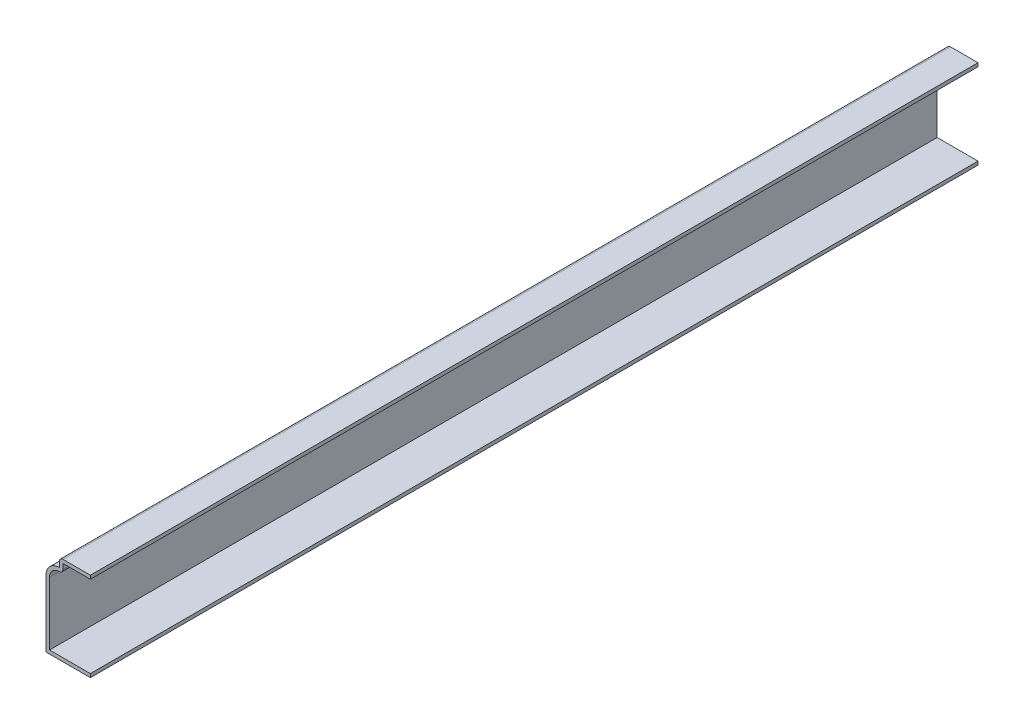
ISO-10303-21;
HEADER;
FILE_DESCRIPTION(('STEP AP214'),'2;1');
FILE_NAME('part.step','',(''),(''),'','','');
FILE_SCHEMA(('AUTOMOTIVE_DESIGN { 1 0 10303 214 1 1 1 1 }'));
ENDSEC;
DATA;
#1=APPLICATION_CONTEXT('core data for automotive mechanical design processes');
#2=APPLICATION_PROTOCOL_DEFINITION('international standard','automotive_design',2000,#1);
#3=PRODUCT_CONTEXT('',#1,'mechanical');
#4=PRODUCT('Part','Part','',(#3));
#5=PRODUCT_RELATED_PRODUCT_CATEGORY('part','',(#4));
#6=PRODUCT_DEFINITION_FORMATION('','',#4);
#7=PRODUCT_DEFINITION_CONTEXT('part definition',#1,'design');
#8=PRODUCT_DEFINITION('design','',#6,#7);
#9=PRODUCT_DEFINITION_SHAPE('','',#8);
#10=(LENGTH_UNIT() NAMED_UNIT(*) SI_UNIT(.MILLI.,.METRE.));
#11=(NAMED_UNIT(*) PLANE_ANGLE_UNIT() SI_UNIT($,.RADIAN.));
#12=(NAMED_UNIT(*) SI_UNIT($,.STERADIAN.) SOLID_ANGLE_UNIT());
#13=UNCERTAINTY_MEASURE_WITH_UNIT(LENGTH_MEASURE(1.E-05),#10,'distance_accuracy_value','');
#14=(GEOMETRIC_REPRESENTATION_CONTEXT(3) GLOBAL_UNCERTAINTY_ASSIGNED_CONTEXT((#13)) GLOBAL_UNIT_ASSIGNED_CONTEXT((#10,
#11,#12)) REPRESENTATION_CONTEXT('',''));
#15=CARTESIAN_POINT('',(0.,0.,0.));
#16=DIRECTION('',(0.,0.,1.));
#17=DIRECTION('',(1.,0.,0.));
#18=AXIS2_PLACEMENT_3D('',#15,#16,#17);
#19=CARTESIAN_POINT('',(-11.1125,30.48,-317.5));
#20=DIRECTION('',(0.,-1.,0.));
#21=DIRECTION('',(0.,0.,-1.));
#22=AXIS2_PLACEMENT_3D('',#19,#20,#21);
#23=PLANE('',#22);
#24=DIRECTION('',(1.,0.,0.));
#25=VECTOR('',#24,1.);
#26=CARTESIAN_POINT('',(-11.1125,30.48,0.));
#27=LINE('',#26,#25);
#28=CARTESIAN_POINT('',(-9.8425,30.48,0.));
#29=VERTEX_POINT('',#28);
#30=CARTESIAN_POINT('',(0.,30.48,0.));
#31=VERTEX_POINT('',#30);
#32=EDGE_CURVE('E186',#29,#31,#27,.T.);
#33=ORIENTED_EDGE('',*,*,#32,.F.);
#34=DIRECTION('',(0.,0.,1.));
#35=VECTOR('',#34,1.);
#36=CARTESIAN_POINT('',(-9.8425,30.48,-317.5));
#37=LINE('',#36,#35);
#38=CARTESIAN_POINT('',(-9.8425,30.48,-317.5));
#39=VERTEX_POINT('',#38);
#40=EDGE_CURVE('E159',#39,#29,#37,.T.);
#41=ORIENTED_EDGE('',*,*,#40,.F.);
#42=DIRECTION('',(1.,0.,0.));
#43=VECTOR('',#42,1.);
#44=CARTESIAN_POINT('',(-11.1125,30.48,-317.5));
#45=LINE('',#44,#43);
#46=CARTESIAN_POINT('',(0.,30.48,-317.5));
#47=VERTEX_POINT('',#46);
#48=EDGE_CURVE('E140',#39,#47,#45,.T.);
#49=ORIENTED_EDGE('',*,*,#48,.T.);
#50=DIRECTION('',(0.,0.,1.));
#51=VECTOR('',#50,1.);
#52=CARTESIAN_POINT('',(0.,30.48,-317.5));
#53=LINE('',#52,#51);
#54=EDGE_CURVE('E147',#47,#31,#53,.T.);
#55=ORIENTED_EDGE('',*,*,#54,.T.);
#56=EDGE_LOOP('',(#33,#41,#49,#55));
#57=FACE_BOUND('',#56,.T.);
#58=ADVANCED_FACE('F35',(#57),#23,.T.);
#59=CARTESIAN_POINT('',(-9.8425,28.575,-317.5));
#60=DIRECTION('',(1.,0.,0.));
#61=DIRECTION('',(0.,0.,-1.));
#62=AXIS2_PLACEMENT_3D('',#59,#60,#61);
#63=PLANE('',#62);
#64=DIRECTION('',(0.,1.,0.));
#65=VECTOR('',#64,1.);
#66=CARTESIAN_POINT('',(-9.8425,28.575,0.));
#67=LINE('',#66,#65);
#68=CARTESIAN_POINT('',(-9.8425,28.575,0.));
#69=VERTEX_POINT('',#68);
#70=EDGE_CURVE('E160',#69,#29,#67,.T.);
#71=ORIENTED_EDGE('',*,*,#70,.F.);
#72=DIRECTION('',(0.,0.,1.));
#73=VECTOR('',#72,1.);
#74=CARTESIAN_POINT('',(-9.8425,28.575,-317.5));
#75=LINE('',#74,#73);
#76=CARTESIAN_POINT('',(-9.8425,28.575,-317.5));
#77=VERTEX_POINT('',#76);
#78=EDGE_CURVE('E236',#69,#77,#75,.F.);
#79=ORIENTED_EDGE('',*,*,#78,.T.);
#80=DIRECTION('',(0.,1.,0.));
#81=VECTOR('',#80,1.);
#82=CARTESIAN_POINT('',(-9.8425,28.575,-317.5));
#83=LINE('',#82,#81);
#84=EDGE_CURVE('E155',#77,#39,#83,.T.);
#85=ORIENTED_EDGE('',*,*,#84,.T.);
#86=ORIENTED_EDGE('',*,*,#40,.T.);
#87=EDGE_LOOP('',(#71,#79,#85,#86));
#88=FACE_BOUND('',#87,.T.);
#89=ADVANCED_FACE('F252',(#88),#63,.T.);
#90=CARTESIAN_POINT('',(-11.1125,23.8125,-317.5));
#91=DIRECTION('',(0.,0.,1.));
#92=DIRECTION('',(1.,0.,0.));
#93=AXIS2_PLACEMENT_3D('',#90,#91,#92);
#94=CYLINDRICAL_SURFACE('',#93,3.4925);
#95=CARTESIAN_POINT('',(-11.1125,23.8125,-317.5));
#96=DIRECTION('',(0.,0.,1.));
#97=DIRECTION('',(1.,0.,0.));
#98=AXIS2_PLACEMENT_3D('',#95,#96,#97);
#99=CIRCLE('',#98,3.4925);
#100=CARTESIAN_POINT('',(-14.605,23.8125,-317.5));
#101=VERTEX_POINT('',#100);
#102=CARTESIAN_POINT('',(-11.1125,27.305,-317.5));
#103=VERTEX_POINT('',#102);
#104=EDGE_CURVE('E182',#101,#103,#99,.F.);
#105=ORIENTED_EDGE('',*,*,#104,.T.);
#106=DIRECTION('',(0.,0.,1.));
#107=VECTOR('',#106,1.);
#108=CARTESIAN_POINT('',(-11.1125,27.305,-317.5));
#109=LINE('',#108,#107);
#110=CARTESIAN_POINT('',(-11.1125,27.305,0.));
#111=VERTEX_POINT('',#110);
#112=EDGE_CURVE('E210',#103,#111,#109,.T.);
#113=ORIENTED_EDGE('',*,*,#112,.T.);
#114=CARTESIAN_POINT('',(-11.1125,23.8125,0.));
#115=DIRECTION('',(0.,0.,1.));
#116=DIRECTION('',(1.,0.,0.));
#117=AXIS2_PLACEMENT_3D('',#114,#115,#116);
#118=CIRCLE('',#117,3.4925);
#119=CARTESIAN_POINT('',(-14.605,23.8125,0.));
#120=VERTEX_POINT('',#119);
#121=EDGE_CURVE('E162',#120,#111,#118,.F.);
#122=ORIENTED_EDGE('',*,*,#121,.F.);
#123=DIRECTION('',(0.,0.,1.));
#124=VECTOR('',#123,1.);
#125=CARTESIAN_POINT('',(-14.605,23.8125,-317.5));
#126=LINE('',#125,#124);
#127=EDGE_CURVE('E211',#101,#120,#126,.T.);
#128=ORIENTED_EDGE('',*,*,#127,.F.);
#129=EDGE_LOOP('',(#105,#113,#122,#128));
#130=FACE_BOUND('',#129,.T.);
#131=ADVANCED_FACE('F260',(#130),#94,.F.);
#132=CARTESIAN_POINT('',(-14.605,0.,-317.5));
#133=DIRECTION('',(1.,0.,0.));
#134=DIRECTION('',(0.,0.,-1.));
#135=AXIS2_PLACEMENT_3D('',#132,#133,#134);
#136=PLANE('',#135);
#137=DIRECTION('',(0.,1.,0.));
#138=VECTOR('',#137,1.);
#139=CARTESIAN_POINT('',(-14.605,0.,0.));
#140=LINE('',#139,#138);
#141=CARTESIAN_POINT('',(-14.605,1.27,0.));
#142=VERTEX_POINT('',#141);
#143=EDGE_CURVE('E204',#142,#120,#140,.T.);
#144=ORIENTED_EDGE('',*,*,#143,.F.);
#145=DIRECTION('',(0.,0.,1.));
#146=VECTOR('',#145,1.);
#147=CARTESIAN_POINT('',(-14.605,1.27,-317.5));
#148=LINE('',#147,#146);
#149=CARTESIAN_POINT('',(-14.605,1.27,-317.5));
#150=VERTEX_POINT('',#149);
#151=EDGE_CURVE('E213',#150,#142,#148,.T.);
#152=ORIENTED_EDGE('',*,*,#151,.F.);
#153=DIRECTION('',(0.,1.,0.));
#154=VECTOR('',#153,1.);
#155=CARTESIAN_POINT('',(-14.605,0.,-317.5));
#156=LINE('',#155,#154);
#157=EDGE_CURVE('E179',#150,#101,#156,.T.);
#158=ORIENTED_EDGE('',*,*,#157,.T.);
#159=ORIENTED_EDGE('',*,*,#127,.T.);
#160=EDGE_LOOP('',(#144,#152,#158,#159));
#161=FACE_BOUND('',#160,.T.);
#162=ADVANCED_FACE('F265',(#161),#136,.T.);
#163=CARTESIAN_POINT('',(0.,1.27,-317.5));
#164=DIRECTION('',(0.,1.,0.));
#165=DIRECTION('',(0.,0.,1.));
#166=AXIS2_PLACEMENT_3D('',#163,#164,#165);
#167=PLANE('',#166);
#168=DIRECTION('',(1.,0.,0.));
#169=VECTOR('',#168,1.);
#170=CARTESIAN_POINT('',(0.,1.27,0.));
#171=LINE('',#170,#169);
#172=CARTESIAN_POINT('',(0.,1.27,0.));
#173=VERTEX_POINT('',#172);
#174=EDGE_CURVE('E201',#173,#142,#171,.F.);
#175=ORIENTED_EDGE('',*,*,#174,.F.);
#176=DIRECTION('',(0.,0.,1.));
#177=VECTOR('',#176,1.);
#178=CARTESIAN_POINT('',(0.,1.27,-317.5));
#179=LINE('',#178,#177);
#180=CARTESIAN_POINT('',(0.,1.27,-317.5));
#181=VERTEX_POINT('',#180);
#182=EDGE_CURVE('E215',#181,#173,#179,.T.);
#183=ORIENTED_EDGE('',*,*,#182,.F.);
#184=DIRECTION('',(1.,0.,0.));
#185=VECTOR('',#184,1.);
#186=CARTESIAN_POINT('',(0.,1.27,-317.5));
#187=LINE('',#186,#185);
#188=EDGE_CURVE('E176',#181,#150,#187,.F.);
#189=ORIENTED_EDGE('',*,*,#188,.T.);
#190=ORIENTED_EDGE('',*,*,#151,.T.);
#191=EDGE_LOOP('',(#175,#183,#189,#190));
#192=FACE_BOUND('',#191,.T.);
#193=ADVANCED_FACE('F269',(#192),#167,.T.);
#194=CARTESIAN_POINT('',(0.,1.27,-317.5));
#195=DIRECTION('',(-1.,0.,0.));
#196=DIRECTION('',(0.,0.,1.));
#197=AXIS2_PLACEMENT_3D('',#194,#195,#196);
#198=PLANE('',#197);
#199=DIRECTION('',(0.,-1.,0.));
#200=VECTOR('',#199,1.);
#201=CARTESIAN_POINT('',(0.,1.27,0.));
#202=LINE('',#201,#200);
#203=CARTESIAN_POINT('',(0.,0.,0.));
#204=VERTEX_POINT('',#203);
#205=EDGE_CURVE('E199',#173,#204,#202,.T.);
#206=ORIENTED_EDGE('',*,*,#205,.T.);
#207=DIRECTION('',(0.,0.,1.));
#208=VECTOR('',#207,1.);
#209=CARTESIAN_POINT('',(0.,0.,-317.5));
#210=LINE('',#209,#208);
#211=CARTESIAN_POINT('',(0.,0.,-317.5));
#212=VERTEX_POINT('',#211);
#213=EDGE_CURVE('E217',#212,#204,#210,.T.);
#214=ORIENTED_EDGE('',*,*,#213,.F.);
#215=DIRECTION('',(0.,-1.,0.));
#216=VECTOR('',#215,1.);
#217=CARTESIAN_POINT('',(0.,1.27,-317.5));
#218=LINE('',#217,#216);
#219=EDGE_CURVE('E174',#181,#212,#218,.T.);
#220=ORIENTED_EDGE('',*,*,#219,.F.);
#221=ORIENTED_EDGE('',*,*,#182,.T.);
#222=EDGE_LOOP('',(#206,#214,#220,#221));
#223=FACE_BOUND('',#222,.T.);
#224=ADVANCED_FACE('F273',(#223),#198,.F.);
#225=CARTESIAN_POINT('',(0.,0.,-317.5));
#226=DIRECTION('',(0.,1.,0.));
#227=DIRECTION('',(0.,0.,1.));
#228=AXIS2_PLACEMENT_3D('',#225,#226,#227);
#229=PLANE('',#228);
#230=DIRECTION('',(-1.,0.,0.));
#231=VECTOR('',#230,1.);
#232=CARTESIAN_POINT('',(0.,0.,0.));
#233=LINE('',#232,#231);
#234=CARTESIAN_POINT('',(-15.875,0.,0.));
#235=VERTEX_POINT('',#234);
#236=EDGE_CURVE('E197',#204,#235,#233,.T.);
#237=ORIENTED_EDGE('',*,*,#236,.T.);
#238=DIRECTION('',(0.,0.,1.));
#239=VECTOR('',#238,1.);
#240=CARTESIAN_POINT('',(-15.875,0.,-317.5));
#241=LINE('',#240,#239);
#242=CARTESIAN_POINT('',(-15.875,0.,-317.5));
#243=VERTEX_POINT('',#242);
#244=EDGE_CURVE('E220',#243,#235,#241,.T.);
#245=ORIENTED_EDGE('',*,*,#244,.F.);
#246=DIRECTION('',(-1.,0.,0.));
#247=VECTOR('',#246,1.);
#248=CARTESIAN_POINT('',(0.,0.,-317.5));
#249=LINE('',#248,#247);
#250=EDGE_CURVE('E172',#212,#243,#249,.T.);
#251=ORIENTED_EDGE('',*,*,#250,.F.);
#252=ORIENTED_EDGE('',*,*,#213,.T.);
#253=EDGE_LOOP('',(#237,#245,#251,#252));
#254=FACE_BOUND('',#253,.T.);
#255=ADVANCED_FACE('F279',(#254),#229,.F.);
#256=CARTESIAN_POINT('',(-15.875,0.,-317.5));
#257=DIRECTION('',(1.,0.,0.));
#258=DIRECTION('',(0.,0.,-1.));
#259=AXIS2_PLACEMENT_3D('',#256,#257,#258);
#260=PLANE('',#259);
#261=DIRECTION('',(0.,1.,0.));
#262=VECTOR('',#261,1.);
#263=CARTESIAN_POINT('',(-15.875,0.,0.));
#264=LINE('',#263,#262);
#265=CARTESIAN_POINT('',(-15.875,23.8125,0.));
#266=VERTEX_POINT('',#265);
#267=EDGE_CURVE('E195',#235,#266,#264,.T.);
#268=ORIENTED_EDGE('',*,*,#267,.T.);
#269=DIRECTION('',(0.,0.,1.));
#270=VECTOR('',#269,1.);
#271=CARTESIAN_POINT('',(-15.875,23.8125,-317.5));
#272=LINE('',#271,#270);
#273=CARTESIAN_POINT('',(-15.875,23.8125,-317.5));
#274=VERTEX_POINT('',#273);
#275=EDGE_CURVE('E223',#274,#266,#272,.T.);
#276=ORIENTED_EDGE('',*,*,#275,.F.);
#277=DIRECTION('',(0.,1.,0.));
#278=VECTOR('',#277,1.);
#279=CARTESIAN_POINT('',(-15.875,0.,-317.5));
#280=LINE('',#279,#278);
#281=EDGE_CURVE('E170',#243,#274,#280,.T.);
#282=ORIENTED_EDGE('',*,*,#281,.F.);
#283=ORIENTED_EDGE('',*,*,#244,.T.);
#284=EDGE_LOOP('',(#268,#276,#282,#283));
#285=FACE_BOUND('',#284,.T.);
#286=ADVANCED_FACE('F283',(#285),#260,.F.);
#287=CARTESIAN_POINT('',(-11.1125,23.8125,-317.5));
#288=DIRECTION('',(0.,0.,1.));
#289=DIRECTION('',(1.,0.,0.));
#290=AXIS2_PLACEMENT_3D('',#287,#288,#289);
#291=CYLINDRICAL_SURFACE('',#290,4.7625);
#292=CARTESIAN_POINT('',(-11.1125,23.8125,0.));
#293=DIRECTION('',(0.,0.,-1.));
#294=DIRECTION('',(-1.,0.,0.));
#295=AXIS2_PLACEMENT_3D('',#292,#293,#294);
#296=CIRCLE('',#295,4.7625);
#297=CARTESIAN_POINT('',(-11.1125,28.575,0.));
#298=VERTEX_POINT('',#297);
#299=EDGE_CURVE('E193',#266,#298,#296,.T.);
#300=ORIENTED_EDGE('',*,*,#299,.T.);
#301=DIRECTION('',(0.,0.,1.));
#302=VECTOR('',#301,1.);
#303=CARTESIAN_POINT('',(-11.1125,28.575,-317.5));
#304=LINE('',#303,#302);
#305=CARTESIAN_POINT('',(-11.1125,28.575,-317.5));
#306=VERTEX_POINT('',#305);
#307=EDGE_CURVE('E226',#306,#298,#304,.T.);
#308=ORIENTED_EDGE('',*,*,#307,.F.);
#309=CARTESIAN_POINT('',(-11.1125,23.8125,-317.5));
#310=DIRECTION('',(0.,0.,-1.));
#311=DIRECTION('',(-1.,0.,0.));
#312=AXIS2_PLACEMENT_3D('',#309,#310,#311);
#313=CIRCLE('',#312,4.7625);
#314=EDGE_CURVE('E168',#274,#306,#313,.T.);
#315=ORIENTED_EDGE('',*,*,#314,.F.);
#316=ORIENTED_EDGE('',*,*,#275,.T.);
#317=EDGE_LOOP('',(#300,#308,#315,#316));
#318=FACE_BOUND('',#317,.T.);
#319=ADVANCED_FACE('F288',(#318),#291,.T.);
#320=CARTESIAN_POINT('',(-11.1125,28.575,-317.5));
#321=DIRECTION('',(1.,0.,0.));
#322=DIRECTION('',(0.,0.,-1.));
#323=AXIS2_PLACEMENT_3D('',#320,#321,#322);
#324=PLANE('',#323);
#325=DIRECTION('',(0.,1.,0.));
#326=VECTOR('',#325,1.);
#327=CARTESIAN_POINT('',(-11.1125,28.575,0.));
#328=LINE('',#327,#326);
#329=CARTESIAN_POINT('',(-11.1125,30.48,0.));
#330=VERTEX_POINT('',#329);
#331=EDGE_CURVE('E191',#298,#330,#328,.T.);
#332=ORIENTED_EDGE('',*,*,#331,.T.);
#333=DIRECTION('',(0.,0.,1.));
#334=VECTOR('',#333,1.);
#335=CARTESIAN_POINT('',(-11.1125,30.48,-317.5));
#336=LINE('',#335,#334);
#337=CARTESIAN_POINT('',(-11.1125,30.48,-317.5));
#338=VERTEX_POINT('',#337);
#339=EDGE_CURVE('E11',#330,#338,#336,.F.);
#340=ORIENTED_EDGE('',*,*,#339,.T.);
#341=DIRECTION('',(0.,1.,0.));
#342=VECTOR('',#341,1.);
#343=CARTESIAN_POINT('',(-11.1125,28.575,-317.5));
#344=LINE('',#343,#342);
#345=EDGE_CURVE('E166',#306,#338,#344,.T.);
#346=ORIENTED_EDGE('',*,*,#345,.F.);
#347=ORIENTED_EDGE('',*,*,#307,.T.);
#348=EDGE_LOOP('',(#332,#340,#346,#347));
#349=FACE_BOUND('',#348,.T.);
#350=ADVANCED_FACE('F304',(#349),#324,.F.);
#351=CARTESIAN_POINT('',(-11.1125,31.75,-317.5));
#352=DIRECTION('',(0.,-1.,0.));
#353=DIRECTION('',(0.,0.,-1.));
#354=AXIS2_PLACEMENT_3D('',#351,#352,#353);
#355=PLANE('',#354);
#356=DIRECTION('',(1.,0.,0.));
#357=VECTOR('',#356,1.);
#358=CARTESIAN_POINT('',(-11.1125,31.75,-317.5));
#359=LINE('',#358,#357);
#360=CARTESIAN_POINT('',(-9.8425,31.75,-317.5));
#361=VERTEX_POINT('',#360);
#362=CARTESIAN_POINT('',(0.,31.75,-317.5));
#363=VERTEX_POINT('',#362);
#364=EDGE_CURVE('E141',#361,#363,#359,.T.);
#365=ORIENTED_EDGE('',*,*,#364,.F.);
#366=DIRECTION('',(0.,0.,1.));
#367=VECTOR('',#366,1.);
#368=CARTESIAN_POINT('',(-9.8425,31.75,-317.5));
#369=LINE('',#368,#367);
#370=CARTESIAN_POINT('',(-9.8425,31.75,0.));
#371=VERTEX_POINT('',#370);
#372=EDGE_CURVE('E43',#361,#371,#369,.T.);
#373=ORIENTED_EDGE('',*,*,#372,.T.);
#374=DIRECTION('',(1.,0.,0.));
#375=VECTOR('',#374,1.);
#376=CARTESIAN_POINT('',(-11.1125,31.75,0.));
#377=LINE('',#376,#375);
#378=CARTESIAN_POINT('',(0.,31.75,0.));
#379=VERTEX_POINT('',#378);
#380=EDGE_CURVE('E189',#371,#379,#377,.T.);
#381=ORIENTED_EDGE('',*,*,#380,.T.);
#382=DIRECTION('',(0.,0.,1.));
#383=VECTOR('',#382,1.);
#384=CARTESIAN_POINT('',(0.,31.75,-317.5));
#385=LINE('',#384,#383);
#386=EDGE_CURVE('E154',#363,#379,#385,.T.);
#387=ORIENTED_EDGE('',*,*,#386,.F.);
#388=EDGE_LOOP('',(#365,#373,#381,#387));
#389=FACE_BOUND('',#388,.T.);
#390=ADVANCED_FACE('F244',(#389),#355,.F.);
#391=CARTESIAN_POINT('',(0.,31.75,-317.5));
#392=DIRECTION('',(-1.,0.,0.));
#393=DIRECTION('',(0.,0.,1.));
#394=AXIS2_PLACEMENT_3D('',#391,#392,#393);
#395=PLANE('',#394);
#396=DIRECTION('',(0.,-1.,0.));
#397=VECTOR('',#396,1.);
#398=CARTESIAN_POINT('',(0.,31.75,0.));
#399=LINE('',#398,#397);
#400=EDGE_CURVE('E150',#379,#31,#399,.T.);
#401=ORIENTED_EDGE('',*,*,#400,.T.);
#402=ORIENTED_EDGE('',*,*,#54,.F.);
#403=DIRECTION('',(0.,-1.,0.));
#404=VECTOR('',#403,1.);
#405=CARTESIAN_POINT('',(0.,31.75,-317.5));
#406=LINE('',#405,#404);
#407=EDGE_CURVE('E135',#363,#47,#406,.T.);
#408=ORIENTED_EDGE('',*,*,#407,.F.);
#409=ORIENTED_EDGE('',*,*,#386,.T.);
#410=EDGE_LOOP('',(#401,#402,#408,#409));
#411=FACE_BOUND('',#410,.T.);
#412=ADVANCED_FACE('F148',(#411),#395,.F.);
#413=CARTESIAN_POINT('',(-11.1125,23.8125,-317.5));
#414=DIRECTION('',(0.,0.,-1.));
#415=DIRECTION('',(-1.,0.,0.));
#416=AXIS2_PLACEMENT_3D('',#413,#414,#415);
#417=PLANE('',#416);
#418=ORIENTED_EDGE('',*,*,#84,.F.);
#419=CARTESIAN_POINT('',(-11.1125,28.575,-317.5));
#420=DIRECTION('',(0.,0.,-1.));
#421=DIRECTION('',(-1.,0.,0.));
#422=AXIS2_PLACEMENT_3D('',#419,#420,#421);
#423=CIRCLE('',#422,1.27);
#424=EDGE_CURVE('E239',#77,#103,#423,.T.);
#425=ORIENTED_EDGE('',*,*,#424,.T.);
#426=ORIENTED_EDGE('',*,*,#104,.F.);
#427=ORIENTED_EDGE('',*,*,#157,.F.);
#428=ORIENTED_EDGE('',*,*,#188,.F.);
#429=ORIENTED_EDGE('',*,*,#219,.T.);
#430=ORIENTED_EDGE('',*,*,#250,.T.);
#431=ORIENTED_EDGE('',*,*,#281,.T.);
#432=ORIENTED_EDGE('',*,*,#314,.T.);
#433=ORIENTED_EDGE('',*,*,#345,.T.);
#434=CARTESIAN_POINT('',(-9.8425,30.48,-317.5));
#435=DIRECTION('',(0.,0.,-1.));
#436=DIRECTION('',(-1.,0.,0.));
#437=AXIS2_PLACEMENT_3D('',#434,#435,#436);
#438=CIRCLE('',#437,1.27);
#439=EDGE_CURVE('E50',#338,#361,#438,.T.);
#440=ORIENTED_EDGE('',*,*,#439,.T.);
#441=ORIENTED_EDGE('',*,*,#364,.T.);
#442=ORIENTED_EDGE('',*,*,#407,.T.);
#443=ORIENTED_EDGE('',*,*,#48,.F.);
#444=EDGE_LOOP('',(#418,#425,#426,#427,#428,#429,#430,#431,#432,#433,#440,#441,#442,#443));
#445=FACE_BOUND('',#444,.T.);
#446=ADVANCED_FACE('F138',(#445),#417,.T.);
#447=CARTESIAN_POINT('',(-11.1125,23.8125,0.));
#448=DIRECTION('',(0.,0.,-1.));
#449=DIRECTION('',(-1.,0.,0.));
#450=AXIS2_PLACEMENT_3D('',#447,#448,#449);
#451=PLANE('',#450);
#452=ORIENTED_EDGE('',*,*,#121,.T.);
#453=CARTESIAN_POINT('',(-11.1125,28.575,0.));
#454=DIRECTION('',(0.,0.,-1.));
#455=DIRECTION('',(-1.,0.,0.));
#456=AXIS2_PLACEMENT_3D('',#453,#454,#455);
#457=CIRCLE('',#456,1.27);
#458=EDGE_CURVE('E234',#111,#69,#457,.F.);
#459=ORIENTED_EDGE('',*,*,#458,.T.);
#460=ORIENTED_EDGE('',*,*,#70,.T.);
#461=ORIENTED_EDGE('',*,*,#32,.T.);
#462=ORIENTED_EDGE('',*,*,#400,.F.);
#463=ORIENTED_EDGE('',*,*,#380,.F.);
#464=CARTESIAN_POINT('',(-9.8425,30.48,0.));
#465=DIRECTION('',(0.,0.,-1.));
#466=DIRECTION('',(-1.,0.,0.));
#467=AXIS2_PLACEMENT_3D('',#464,#465,#466);
#468=CIRCLE('',#467,1.27);
#469=EDGE_CURVE('E232',#371,#330,#468,.F.);
#470=ORIENTED_EDGE('',*,*,#469,.T.);
#471=ORIENTED_EDGE('',*,*,#331,.F.);
#472=ORIENTED_EDGE('',*,*,#299,.F.);
#473=ORIENTED_EDGE('',*,*,#267,.F.);
#474=ORIENTED_EDGE('',*,*,#236,.F.);
#475=ORIENTED_EDGE('',*,*,#205,.F.);
#476=ORIENTED_EDGE('',*,*,#174,.T.);
#477=ORIENTED_EDGE('',*,*,#143,.T.);
#478=EDGE_LOOP('',(#452,#459,#460,#461,#462,#463,#470,#471,#472,#473,#474,#475,#476,#477));
#479=FACE_BOUND('',#478,.T.);
#480=ADVANCED_FACE('F247',(#479),#451,.F.);
#481=CARTESIAN_POINT('',(-11.1125,28.575,-317.5));
#482=DIRECTION('',(0.,0.,1.));
#483=DIRECTION('',(1.,0.,0.));
#484=AXIS2_PLACEMENT_3D('',#481,#482,#483);
#485=CYLINDRICAL_SURFACE('',#484,1.27);
#486=ORIENTED_EDGE('',*,*,#424,.F.);
#487=ORIENTED_EDGE('',*,*,#78,.F.);
#488=ORIENTED_EDGE('',*,*,#458,.F.);
#489=ORIENTED_EDGE('',*,*,#112,.F.);
#490=EDGE_LOOP('',(#486,#487,#488,#489));
#491=FACE_BOUND('',#490,.T.);
#492=ADVANCED_FACE('F257',(#491),#485,.T.);
#493=CARTESIAN_POINT('',(-9.8425,30.48,-317.5));
#494=DIRECTION('',(0.,0.,1.));
#495=DIRECTION('',(1.,0.,0.));
#496=AXIS2_PLACEMENT_3D('',#493,#494,#495);
#497=CYLINDRICAL_SURFACE('',#496,1.27);
#498=ORIENTED_EDGE('',*,*,#439,.F.);
#499=ORIENTED_EDGE('',*,*,#339,.F.);
#500=ORIENTED_EDGE('',*,*,#469,.F.);
#501=ORIENTED_EDGE('',*,*,#372,.F.);
#502=EDGE_LOOP('',(#498,#499,#500,#501));
#503=FACE_BOUND('',#502,.T.);
#504=ADVANCED_FACE('F37',(#503),#497,.T.);
#505=CLOSED_SHELL('',(#58,#89,#131,#162,#193,#224,#255,#286,#319,#350,#390,#412,#446,#480,#492,#504));
#506=MANIFOLD_SOLID_BREP('B2',#505);
#507=ADVANCED_BREP_SHAPE_REPRESENTATION('',(#18,#506),#14);
#508=SHAPE_DEFINITION_REPRESENTATION(#9,#507);
ENDSEC;
END-ISO-10303-21;
